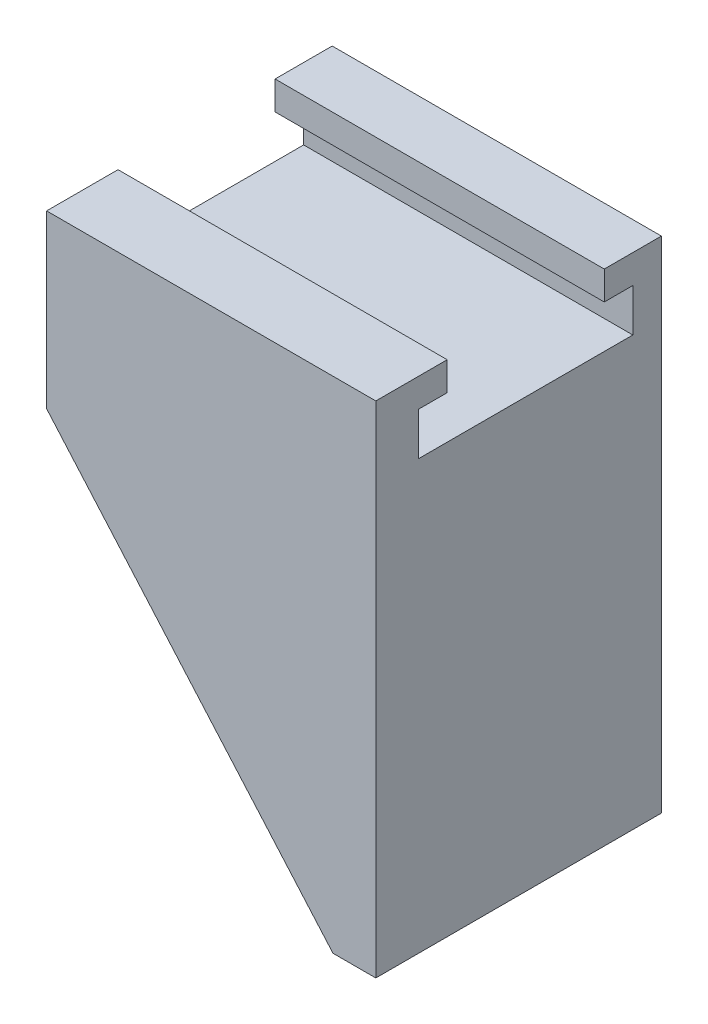
ISO-10303-21;
HEADER;
FILE_DESCRIPTION(('STEP AP214'),'2;1');
FILE_NAME('part.step','',(''),(''),'','','');
FILE_SCHEMA(('AUTOMOTIVE_DESIGN { 1 0 10303 214 1 1 1 1 }'));
ENDSEC;
DATA;
#1=APPLICATION_CONTEXT('core data for automotive mechanical design processes');
#2=APPLICATION_PROTOCOL_DEFINITION('international standard','automotive_design',2000,#1);
#3=PRODUCT_CONTEXT('',#1,'mechanical');
#4=PRODUCT('Part','Part','',(#3));
#5=PRODUCT_RELATED_PRODUCT_CATEGORY('part','',(#4));
#6=PRODUCT_DEFINITION_FORMATION('','',#4);
#7=PRODUCT_DEFINITION_CONTEXT('part definition',#1,'design');
#8=PRODUCT_DEFINITION('design','',#6,#7);
#9=PRODUCT_DEFINITION_SHAPE('','',#8);
#10=(LENGTH_UNIT() NAMED_UNIT(*) SI_UNIT(.MILLI.,.METRE.));
#11=(NAMED_UNIT(*) PLANE_ANGLE_UNIT() SI_UNIT($,.RADIAN.));
#12=(NAMED_UNIT(*) SI_UNIT($,.STERADIAN.) SOLID_ANGLE_UNIT());
#13=UNCERTAINTY_MEASURE_WITH_UNIT(LENGTH_MEASURE(1.E-05),#10,'distance_accuracy_value','');
#14=(GEOMETRIC_REPRESENTATION_CONTEXT(3) GLOBAL_UNCERTAINTY_ASSIGNED_CONTEXT((#13)) GLOBAL_UNIT_ASSIGNED_CONTEXT((#10,
#11,#12)) REPRESENTATION_CONTEXT('',''));
#15=CARTESIAN_POINT('',(0.,0.,0.));
#16=DIRECTION('',(0.,0.,1.));
#17=DIRECTION('',(1.,0.,0.));
#18=AXIS2_PLACEMENT_3D('',#15,#16,#17);
#19=CARTESIAN_POINT('',(0.,35.,-20.));
#20=DIRECTION('',(0.,1.,0.));
#21=DIRECTION('',(0.,0.,-1.));
#22=AXIS2_PLACEMENT_3D('',#19,#20,#21);
#23=PLANE('',#22);
#24=DIRECTION('',(0.,0.,1.));
#25=VECTOR('',#24,1.);
#26=CARTESIAN_POINT('',(-20.0538947368421,35.,-20.));
#27=LINE('',#26,#25);
#28=CARTESIAN_POINT('',(-20.0538947368421,35.,-5.00000000000001));
#29=VERTEX_POINT('',#28);
#30=CARTESIAN_POINT('',(-20.0538947368421,35.,0.));
#31=VERTEX_POINT('',#30);
#32=EDGE_CURVE('E47',#29,#31,#27,.T.);
#33=ORIENTED_EDGE('',*,*,#32,.T.);
#34=DIRECTION('',(1.,0.,0.));
#35=VECTOR('',#34,1.);
#36=CARTESIAN_POINT('',(0.,35.,0.));
#37=LINE('',#36,#35);
#38=CARTESIAN_POINT('',(3.,35.,0.));
#39=VERTEX_POINT('',#38);
#40=EDGE_CURVE('E130',#31,#39,#37,.T.);
#41=ORIENTED_EDGE('',*,*,#40,.T.);
#42=DIRECTION('',(0.,0.,1.));
#43=VECTOR('',#42,1.);
#44=CARTESIAN_POINT('',(3.,35.,-20.));
#45=LINE('',#44,#43);
#46=CARTESIAN_POINT('',(3.,35.,-5.00000000000001));
#47=VERTEX_POINT('',#46);
#48=EDGE_CURVE('E129',#47,#39,#45,.T.);
#49=ORIENTED_EDGE('',*,*,#48,.F.);
#50=DIRECTION('',(1.,0.,0.));
#51=VECTOR('',#50,1.);
#52=CARTESIAN_POINT('',(-20.0538947368421,35.,-5.00000000000001));
#53=LINE('',#52,#51);
#54=EDGE_CURVE('E151',#29,#47,#53,.T.);
#55=ORIENTED_EDGE('',*,*,#54,.F.);
#56=EDGE_LOOP('',(#33,#41,#49,#55));
#57=FACE_BOUND('',#56,.T.);
#58=ADVANCED_FACE('F39',(#57),#23,.T.);
#59=DIRECTION('',(1.,0.,0.));
#60=VECTOR('',#59,1.);
#61=CARTESIAN_POINT('',(-20.0538947368421,35.,-16.));
#62=LINE('',#61,#60);
#63=CARTESIAN_POINT('',(-20.0538947368421,35.,-16.));
#64=VERTEX_POINT('',#63);
#65=CARTESIAN_POINT('',(3.,35.,-16.));
#66=VERTEX_POINT('',#65);
#67=EDGE_CURVE('E254',#64,#66,#62,.T.);
#68=ORIENTED_EDGE('',*,*,#67,.T.);
#69=CARTESIAN_POINT('',(3.,35.,-20.));
#70=VERTEX_POINT('',#69);
#71=EDGE_CURVE('E141',#70,#66,#45,.T.);
#72=ORIENTED_EDGE('',*,*,#71,.F.);
#73=DIRECTION('',(1.,0.,0.));
#74=VECTOR('',#73,1.);
#75=CARTESIAN_POINT('',(0.,35.,-20.));
#76=LINE('',#75,#74);
#77=CARTESIAN_POINT('',(-20.0538947368421,35.,-20.));
#78=VERTEX_POINT('',#77);
#79=EDGE_CURVE('E124',#78,#70,#76,.T.);
#80=ORIENTED_EDGE('',*,*,#79,.F.);
#81=EDGE_CURVE('E11',#78,#64,#27,.T.);
#82=ORIENTED_EDGE('',*,*,#81,.T.);
#83=EDGE_LOOP('',(#68,#72,#80,#82));
#84=FACE_BOUND('',#83,.T.);
#85=ADVANCED_FACE('F41',(#84),#23,.T.);
#86=CARTESIAN_POINT('',(-20.0538947368421,0.,-20.));
#87=DIRECTION('',(1.,0.,0.));
#88=DIRECTION('',(0.,1.,0.));
#89=AXIS2_PLACEMENT_3D('',#86,#87,#88);
#90=PLANE('',#89);
#91=ORIENTED_EDGE('',*,*,#81,.F.);
#92=DIRECTION('',(0.,-1.,0.));
#93=VECTOR('',#92,1.);
#94=CARTESIAN_POINT('',(-20.0538947368421,0.,-20.));
#95=LINE('',#94,#93);
#96=CARTESIAN_POINT('',(-20.0538947368421,23.,-20.));
#97=VERTEX_POINT('',#96);
#98=EDGE_CURVE('E95',#78,#97,#95,.T.);
#99=ORIENTED_EDGE('',*,*,#98,.T.);
#100=DIRECTION('',(0.,0.,1.));
#101=VECTOR('',#100,1.);
#102=CARTESIAN_POINT('',(-20.0538947368421,23.,-20.));
#103=LINE('',#102,#101);
#104=CARTESIAN_POINT('',(-20.0538947368421,23.,0.));
#105=VERTEX_POINT('',#104);
#106=EDGE_CURVE('E118',#97,#105,#103,.T.);
#107=ORIENTED_EDGE('',*,*,#106,.T.);
#108=DIRECTION('',(0.,-1.,0.));
#109=VECTOR('',#108,1.);
#110=CARTESIAN_POINT('',(-20.0538947368421,0.,0.));
#111=LINE('',#110,#109);
#112=EDGE_CURVE('E133',#31,#105,#111,.T.);
#113=ORIENTED_EDGE('',*,*,#112,.F.);
#114=ORIENTED_EDGE('',*,*,#32,.F.);
#115=DIRECTION('',(0.,-1.,0.));
#116=VECTOR('',#115,1.);
#117=CARTESIAN_POINT('',(-20.0538947368421,0.,-5.00000000000001));
#118=LINE('',#117,#116);
#119=CARTESIAN_POINT('',(-20.0538947368421,33.,-5.00000000000001));
#120=VERTEX_POINT('',#119);
#121=EDGE_CURVE('E157',#29,#120,#118,.T.);
#122=ORIENTED_EDGE('',*,*,#121,.T.);
#123=DIRECTION('',(0.,0.,1.));
#124=VECTOR('',#123,1.);
#125=CARTESIAN_POINT('',(-20.0538947368421,33.,0.));
#126=LINE('',#125,#124);
#127=CARTESIAN_POINT('',(-20.0538947368421,33.,-3.00000000000001));
#128=VERTEX_POINT('',#127);
#129=EDGE_CURVE('E210',#120,#128,#126,.T.);
#130=ORIENTED_EDGE('',*,*,#129,.T.);
#131=DIRECTION('',(0.,-1.,0.));
#132=VECTOR('',#131,1.);
#133=CARTESIAN_POINT('',(-20.0538947368421,0.,-3.));
#134=LINE('',#133,#132);
#135=CARTESIAN_POINT('',(-20.0538947368421,30.,-3.00000000000001));
#136=VERTEX_POINT('',#135);
#137=EDGE_CURVE('E217',#128,#136,#134,.T.);
#138=ORIENTED_EDGE('',*,*,#137,.T.);
#139=DIRECTION('',(0.,0.,-1.));
#140=VECTOR('',#139,1.);
#141=CARTESIAN_POINT('',(-20.0538947368421,30.,0.));
#142=LINE('',#141,#140);
#143=CARTESIAN_POINT('',(-20.0538947368421,30.,-18.));
#144=VERTEX_POINT('',#143);
#145=EDGE_CURVE('E220',#136,#144,#142,.T.);
#146=ORIENTED_EDGE('',*,*,#145,.T.);
#147=DIRECTION('',(0.,-1.,0.));
#148=VECTOR('',#147,1.);
#149=CARTESIAN_POINT('',(-20.0538947368421,0.,-18.));
#150=LINE('',#149,#148);
#151=CARTESIAN_POINT('',(-20.0538947368421,33.,-18.));
#152=VERTEX_POINT('',#151);
#153=EDGE_CURVE('E231',#152,#144,#150,.T.);
#154=ORIENTED_EDGE('',*,*,#153,.F.);
#155=DIRECTION('',(0.,0.,-1.));
#156=VECTOR('',#155,1.);
#157=CARTESIAN_POINT('',(-20.0538947368421,33.,0.));
#158=LINE('',#157,#156);
#159=CARTESIAN_POINT('',(-20.0538947368421,33.,-16.));
#160=VERTEX_POINT('',#159);
#161=EDGE_CURVE('E229',#160,#152,#158,.T.);
#162=ORIENTED_EDGE('',*,*,#161,.F.);
#163=DIRECTION('',(0.,-1.,0.));
#164=VECTOR('',#163,1.);
#165=CARTESIAN_POINT('',(-20.0538947368421,0.,-16.));
#166=LINE('',#165,#164);
#167=EDGE_CURVE('E223',#64,#160,#166,.T.);
#168=ORIENTED_EDGE('',*,*,#167,.F.);
#169=EDGE_LOOP('',(#91,#99,#107,#113,#114,#122,#130,#138,#146,#154,#162,#168));
#170=FACE_BOUND('',#169,.T.);
#171=ADVANCED_FACE('F153',(#170),#90,.F.);
#172=CARTESIAN_POINT('',(0.,0.,-20.));
#173=DIRECTION('',(0.753730318125683,0.657183846072129,0.));
#174=DIRECTION('',(-0.657183846072129,0.753730318125683,0.));
#175=AXIS2_PLACEMENT_3D('',#172,#173,#174);
#176=PLANE('',#175);
#177=DIRECTION('',(0.657183846072129,-0.753730318125683,0.));
#178=VECTOR('',#177,1.);
#179=CARTESIAN_POINT('',(0.,0.,0.));
#180=LINE('',#179,#178);
#181=CARTESIAN_POINT('',(0.,0.,0.));
#182=VERTEX_POINT('',#181);
#183=EDGE_CURVE('E137',#105,#182,#180,.T.);
#184=ORIENTED_EDGE('',*,*,#183,.F.);
#185=ORIENTED_EDGE('',*,*,#106,.F.);
#186=DIRECTION('',(0.657183846072129,-0.753730318125683,0.));
#187=VECTOR('',#186,1.);
#188=CARTESIAN_POINT('',(0.,0.,-20.));
#189=LINE('',#188,#187);
#190=CARTESIAN_POINT('',(0.,0.,-20.));
#191=VERTEX_POINT('',#190);
#192=EDGE_CURVE('E107',#97,#191,#189,.T.);
#193=ORIENTED_EDGE('',*,*,#192,.T.);
#194=DIRECTION('',(0.,0.,1.));
#195=VECTOR('',#194,1.);
#196=CARTESIAN_POINT('',(0.,0.,-20.));
#197=LINE('',#196,#195);
#198=EDGE_CURVE('E113',#191,#182,#197,.T.);
#199=ORIENTED_EDGE('',*,*,#198,.T.);
#200=EDGE_LOOP('',(#184,#185,#193,#199));
#201=FACE_BOUND('',#200,.T.);
#202=ADVANCED_FACE('F121',(#201),#176,.F.);
#203=CARTESIAN_POINT('',(0.,0.,-20.));
#204=DIRECTION('',(0.,1.,0.));
#205=DIRECTION('',(0.,0.,-1.));
#206=AXIS2_PLACEMENT_3D('',#203,#204,#205);
#207=PLANE('',#206);
#208=DIRECTION('',(1.,0.,0.));
#209=VECTOR('',#208,1.);
#210=CARTESIAN_POINT('',(0.,0.,0.));
#211=LINE('',#210,#209);
#212=CARTESIAN_POINT('',(3.,0.,0.));
#213=VERTEX_POINT('',#212);
#214=EDGE_CURVE('E115',#182,#213,#211,.T.);
#215=ORIENTED_EDGE('',*,*,#214,.F.);
#216=ORIENTED_EDGE('',*,*,#198,.F.);
#217=DIRECTION('',(1.,0.,0.));
#218=VECTOR('',#217,1.);
#219=CARTESIAN_POINT('',(0.,0.,-20.));
#220=LINE('',#219,#218);
#221=CARTESIAN_POINT('',(3.,0.,-20.));
#222=VERTEX_POINT('',#221);
#223=EDGE_CURVE('E103',#191,#222,#220,.T.);
#224=ORIENTED_EDGE('',*,*,#223,.T.);
#225=DIRECTION('',(0.,0.,1.));
#226=VECTOR('',#225,1.);
#227=CARTESIAN_POINT('',(3.,0.,-20.));
#228=LINE('',#227,#226);
#229=EDGE_CURVE('E119',#222,#213,#228,.T.);
#230=ORIENTED_EDGE('',*,*,#229,.T.);
#231=EDGE_LOOP('',(#215,#216,#224,#230));
#232=FACE_BOUND('',#231,.T.);
#233=ADVANCED_FACE('F114',(#232),#207,.F.);
#234=CARTESIAN_POINT('',(3.,0.,-20.));
#235=DIRECTION('',(-1.,0.,0.));
#236=DIRECTION('',(0.,0.,-1.));
#237=AXIS2_PLACEMENT_3D('',#234,#235,#236);
#238=PLANE('',#237);
#239=DIRECTION('',(0.,0.,-1.));
#240=VECTOR('',#239,1.);
#241=CARTESIAN_POINT('',(3.,33.,0.));
#242=LINE('',#241,#240);
#243=CARTESIAN_POINT('',(3.,33.,-16.));
#244=VERTEX_POINT('',#243);
#245=CARTESIAN_POINT('',(3.,33.,-18.));
#246=VERTEX_POINT('',#245);
#247=EDGE_CURVE('E244',#244,#246,#242,.T.);
#248=ORIENTED_EDGE('',*,*,#247,.T.);
#249=DIRECTION('',(0.,-1.,0.));
#250=VECTOR('',#249,1.);
#251=CARTESIAN_POINT('',(3.,0.,-18.));
#252=LINE('',#251,#250);
#253=CARTESIAN_POINT('',(3.,30.,-18.));
#254=VERTEX_POINT('',#253);
#255=EDGE_CURVE('E247',#246,#254,#252,.T.);
#256=ORIENTED_EDGE('',*,*,#255,.T.);
#257=DIRECTION('',(0.,0.,-1.));
#258=VECTOR('',#257,1.);
#259=CARTESIAN_POINT('',(3.,30.,0.));
#260=LINE('',#259,#258);
#261=CARTESIAN_POINT('',(3.,30.,-3.00000000000001));
#262=VERTEX_POINT('',#261);
#263=EDGE_CURVE('E233',#262,#254,#260,.T.);
#264=ORIENTED_EDGE('',*,*,#263,.F.);
#265=DIRECTION('',(0.,-1.,0.));
#266=VECTOR('',#265,1.);
#267=CARTESIAN_POINT('',(3.,0.,-3.));
#268=LINE('',#267,#266);
#269=CARTESIAN_POINT('',(3.,33.,-3.00000000000001));
#270=VERTEX_POINT('',#269);
#271=EDGE_CURVE('E235',#270,#262,#268,.T.);
#272=ORIENTED_EDGE('',*,*,#271,.F.);
#273=DIRECTION('',(0.,0.,1.));
#274=VECTOR('',#273,1.);
#275=CARTESIAN_POINT('',(3.,33.,0.));
#276=LINE('',#275,#274);
#277=CARTESIAN_POINT('',(3.,33.,-5.00000000000001));
#278=VERTEX_POINT('',#277);
#279=EDGE_CURVE('E212',#278,#270,#276,.T.);
#280=ORIENTED_EDGE('',*,*,#279,.F.);
#281=DIRECTION('',(0.,-1.,0.));
#282=VECTOR('',#281,1.);
#283=CARTESIAN_POINT('',(3.,0.,-5.00000000000001));
#284=LINE('',#283,#282);
#285=EDGE_CURVE('E238',#47,#278,#284,.T.);
#286=ORIENTED_EDGE('',*,*,#285,.F.);
#287=ORIENTED_EDGE('',*,*,#48,.T.);
#288=DIRECTION('',(0.,1.,0.));
#289=VECTOR('',#288,1.);
#290=CARTESIAN_POINT('',(3.,0.,0.));
#291=LINE('',#290,#289);
#292=EDGE_CURVE('E87',#213,#39,#291,.T.);
#293=ORIENTED_EDGE('',*,*,#292,.F.);
#294=ORIENTED_EDGE('',*,*,#229,.F.);
#295=DIRECTION('',(0.,1.,0.));
#296=VECTOR('',#295,1.);
#297=CARTESIAN_POINT('',(3.,0.,-20.));
#298=LINE('',#297,#296);
#299=EDGE_CURVE('E63',#222,#70,#298,.T.);
#300=ORIENTED_EDGE('',*,*,#299,.T.);
#301=ORIENTED_EDGE('',*,*,#71,.T.);
#302=DIRECTION('',(0.,-1.,0.));
#303=VECTOR('',#302,1.);
#304=CARTESIAN_POINT('',(3.,0.,-16.));
#305=LINE('',#304,#303);
#306=EDGE_CURVE('E241',#66,#244,#305,.T.);
#307=ORIENTED_EDGE('',*,*,#306,.T.);
#308=EDGE_LOOP('',(#248,#256,#264,#272,#280,#286,#287,#293,#294,#300,#301,#307));
#309=FACE_BOUND('',#308,.T.);
#310=ADVANCED_FACE('F263',(#309),#238,.F.);
#311=CARTESIAN_POINT('',(0.,0.,-20.));
#312=DIRECTION('',(0.,0.,-1.));
#313=DIRECTION('',(1.,0.,0.));
#314=AXIS2_PLACEMENT_3D('',#311,#312,#313);
#315=PLANE('',#314);
#316=ORIENTED_EDGE('',*,*,#79,.T.);
#317=ORIENTED_EDGE('',*,*,#299,.F.);
#318=ORIENTED_EDGE('',*,*,#223,.F.);
#319=ORIENTED_EDGE('',*,*,#192,.F.);
#320=ORIENTED_EDGE('',*,*,#98,.F.);
#321=EDGE_LOOP('',(#316,#317,#318,#319,#320));
#322=FACE_BOUND('',#321,.T.);
#323=ADVANCED_FACE('F105',(#322),#315,.T.);
#324=CARTESIAN_POINT('',(0.,0.,0.));
#325=DIRECTION('',(0.,0.,-1.));
#326=DIRECTION('',(1.,0.,0.));
#327=AXIS2_PLACEMENT_3D('',#324,#325,#326);
#328=PLANE('',#327);
#329=ORIENTED_EDGE('',*,*,#40,.F.);
#330=ORIENTED_EDGE('',*,*,#112,.T.);
#331=ORIENTED_EDGE('',*,*,#183,.T.);
#332=ORIENTED_EDGE('',*,*,#214,.T.);
#333=ORIENTED_EDGE('',*,*,#292,.T.);
#334=EDGE_LOOP('',(#329,#330,#331,#332,#333));
#335=FACE_BOUND('',#334,.T.);
#336=ADVANCED_FACE('F273',(#335),#328,.F.);
#337=CARTESIAN_POINT('',(-20.0538947368421,30.,0.));
#338=DIRECTION('',(0.,1.,0.));
#339=DIRECTION('',(0.,0.,-1.));
#340=AXIS2_PLACEMENT_3D('',#337,#338,#339);
#341=PLANE('',#340);
#342=ORIENTED_EDGE('',*,*,#263,.T.);
#343=DIRECTION('',(1.,0.,0.));
#344=VECTOR('',#343,1.);
#345=CARTESIAN_POINT('',(-20.0538947368421,30.,-18.));
#346=LINE('',#345,#344);
#347=EDGE_CURVE('E134',#144,#254,#346,.T.);
#348=ORIENTED_EDGE('',*,*,#347,.F.);
#349=ORIENTED_EDGE('',*,*,#145,.F.);
#350=DIRECTION('',(1.,0.,0.));
#351=VECTOR('',#350,1.);
#352=CARTESIAN_POINT('',(-20.0538947368421,30.,-3.00000000000001));
#353=LINE('',#352,#351);
#354=EDGE_CURVE('E54',#136,#262,#353,.T.);
#355=ORIENTED_EDGE('',*,*,#354,.T.);
#356=EDGE_LOOP('',(#342,#348,#349,#355));
#357=FACE_BOUND('',#356,.T.);
#358=ADVANCED_FACE('F271',(#357),#341,.T.);
#359=CARTESIAN_POINT('',(-20.0538947368421,0.,-18.));
#360=DIRECTION('',(0.,0.,-1.));
#361=DIRECTION('',(1.,0.,0.));
#362=AXIS2_PLACEMENT_3D('',#359,#360,#361);
#363=PLANE('',#362);
#364=ORIENTED_EDGE('',*,*,#255,.F.);
#365=DIRECTION('',(1.,0.,0.));
#366=VECTOR('',#365,1.);
#367=CARTESIAN_POINT('',(-20.0538947368421,33.,-18.));
#368=LINE('',#367,#366);
#369=EDGE_CURVE('E195',#152,#246,#368,.T.);
#370=ORIENTED_EDGE('',*,*,#369,.F.);
#371=ORIENTED_EDGE('',*,*,#153,.T.);
#372=ORIENTED_EDGE('',*,*,#347,.T.);
#373=EDGE_LOOP('',(#364,#370,#371,#372));
#374=FACE_BOUND('',#373,.T.);
#375=ADVANCED_FACE('F269',(#374),#363,.F.);
#376=CARTESIAN_POINT('',(-20.0538947368421,33.,0.));
#377=DIRECTION('',(0.,1.,0.));
#378=DIRECTION('',(0.,0.,-1.));
#379=AXIS2_PLACEMENT_3D('',#376,#377,#378);
#380=PLANE('',#379);
#381=ORIENTED_EDGE('',*,*,#247,.F.);
#382=DIRECTION('',(1.,0.,0.));
#383=VECTOR('',#382,1.);
#384=CARTESIAN_POINT('',(-20.0538947368421,33.,-16.));
#385=LINE('',#384,#383);
#386=EDGE_CURVE('E252',#160,#244,#385,.T.);
#387=ORIENTED_EDGE('',*,*,#386,.F.);
#388=ORIENTED_EDGE('',*,*,#161,.T.);
#389=ORIENTED_EDGE('',*,*,#369,.T.);
#390=EDGE_LOOP('',(#381,#387,#388,#389));
#391=FACE_BOUND('',#390,.T.);
#392=ADVANCED_FACE('F265',(#391),#380,.F.);
#393=CARTESIAN_POINT('',(-20.0538947368421,0.,-16.));
#394=DIRECTION('',(0.,0.,-1.));
#395=DIRECTION('',(1.,0.,0.));
#396=AXIS2_PLACEMENT_3D('',#393,#394,#395);
#397=PLANE('',#396);
#398=ORIENTED_EDGE('',*,*,#306,.F.);
#399=ORIENTED_EDGE('',*,*,#67,.F.);
#400=ORIENTED_EDGE('',*,*,#167,.T.);
#401=ORIENTED_EDGE('',*,*,#386,.T.);
#402=EDGE_LOOP('',(#398,#399,#400,#401));
#403=FACE_BOUND('',#402,.T.);
#404=ADVANCED_FACE('F268',(#403),#397,.F.);
#405=CARTESIAN_POINT('',(-20.0538947368421,0.,-5.00000000000001));
#406=DIRECTION('',(0.,0.,-1.));
#407=DIRECTION('',(1.,0.,0.));
#408=AXIS2_PLACEMENT_3D('',#405,#406,#407);
#409=PLANE('',#408);
#410=ORIENTED_EDGE('',*,*,#285,.T.);
#411=DIRECTION('',(1.,0.,0.));
#412=VECTOR('',#411,1.);
#413=CARTESIAN_POINT('',(-20.0538947368421,33.,-5.00000000000001));
#414=LINE('',#413,#412);
#415=EDGE_CURVE('E214',#120,#278,#414,.T.);
#416=ORIENTED_EDGE('',*,*,#415,.F.);
#417=ORIENTED_EDGE('',*,*,#121,.F.);
#418=ORIENTED_EDGE('',*,*,#54,.T.);
#419=EDGE_LOOP('',(#410,#416,#417,#418));
#420=FACE_BOUND('',#419,.T.);
#421=ADVANCED_FACE('F334',(#420),#409,.T.);
#422=CARTESIAN_POINT('',(-20.0538947368421,33.,0.));
#423=DIRECTION('',(0.,-1.,0.));
#424=DIRECTION('',(0.,0.,1.));
#425=AXIS2_PLACEMENT_3D('',#422,#423,#424);
#426=PLANE('',#425);
#427=ORIENTED_EDGE('',*,*,#279,.T.);
#428=DIRECTION('',(1.,0.,0.));
#429=VECTOR('',#428,1.);
#430=CARTESIAN_POINT('',(-20.0538947368421,33.,-3.00000000000001));
#431=LINE('',#430,#429);
#432=EDGE_CURVE('E208',#128,#270,#431,.T.);
#433=ORIENTED_EDGE('',*,*,#432,.F.);
#434=ORIENTED_EDGE('',*,*,#129,.F.);
#435=ORIENTED_EDGE('',*,*,#415,.T.);
#436=EDGE_LOOP('',(#427,#433,#434,#435));
#437=FACE_BOUND('',#436,.T.);
#438=ADVANCED_FACE('F209',(#437),#426,.T.);
#439=CARTESIAN_POINT('',(-20.0538947368421,0.,-3.));
#440=DIRECTION('',(0.,0.,-1.));
#441=DIRECTION('',(0.,-1.,0.));
#442=AXIS2_PLACEMENT_3D('',#439,#440,#441);
#443=PLANE('',#442);
#444=ORIENTED_EDGE('',*,*,#271,.T.);
#445=ORIENTED_EDGE('',*,*,#354,.F.);
#446=ORIENTED_EDGE('',*,*,#137,.F.);
#447=ORIENTED_EDGE('',*,*,#432,.T.);
#448=EDGE_LOOP('',(#444,#445,#446,#447));
#449=FACE_BOUND('',#448,.T.);
#450=ADVANCED_FACE('F218',(#449),#443,.T.);
#451=CLOSED_SHELL('',(#58,#85,#171,#202,#233,#310,#323,#336,#358,#375,#392,#404,#421,#438,#450));
#452=MANIFOLD_SOLID_BREP('B2',#451);
#453=ADVANCED_BREP_SHAPE_REPRESENTATION('',(#18,#452),#14);
#454=SHAPE_DEFINITION_REPRESENTATION(#9,#453);
ENDSEC;
END-ISO-10303-21;
